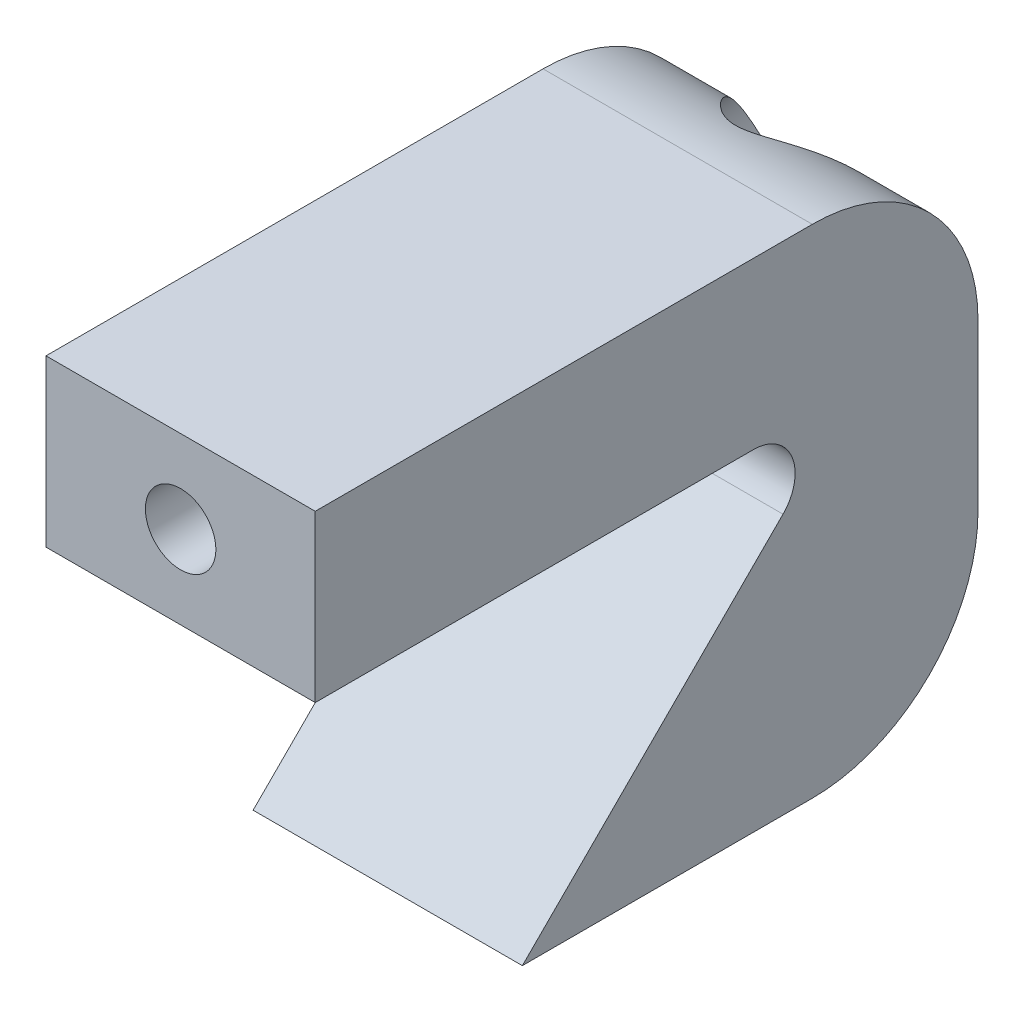
ISO-10303-21;
HEADER;
FILE_DESCRIPTION(('STEP AP214'),'2;1');
FILE_NAME('part.step','',(''),(''),'','','');
FILE_SCHEMA(('AUTOMOTIVE_DESIGN { 1 0 10303 214 1 1 1 1 }'));
ENDSEC;
DATA;
#1=APPLICATION_CONTEXT('core data for automotive mechanical design processes');
#2=APPLICATION_PROTOCOL_DEFINITION('international standard','automotive_design',2000,#1);
#3=PRODUCT_CONTEXT('',#1,'mechanical');
#4=PRODUCT('Part','Part','',(#3));
#5=PRODUCT_RELATED_PRODUCT_CATEGORY('part','',(#4));
#6=PRODUCT_DEFINITION_FORMATION('','',#4);
#7=PRODUCT_DEFINITION_CONTEXT('part definition',#1,'design');
#8=PRODUCT_DEFINITION('design','',#6,#7);
#9=PRODUCT_DEFINITION_SHAPE('','',#8);
#10=(LENGTH_UNIT() NAMED_UNIT(*) SI_UNIT(.MILLI.,.METRE.));
#11=(NAMED_UNIT(*) PLANE_ANGLE_UNIT() SI_UNIT($,.RADIAN.));
#12=(NAMED_UNIT(*) SI_UNIT($,.STERADIAN.) SOLID_ANGLE_UNIT());
#13=UNCERTAINTY_MEASURE_WITH_UNIT(LENGTH_MEASURE(1.E-05),#10,'distance_accuracy_value','');
#14=(GEOMETRIC_REPRESENTATION_CONTEXT(3) GLOBAL_UNCERTAINTY_ASSIGNED_CONTEXT((#13)) GLOBAL_UNIT_ASSIGNED_CONTEXT((#10,
#11,#12)) REPRESENTATION_CONTEXT('',''));
#15=CARTESIAN_POINT('',(0.,0.,0.));
#16=DIRECTION('',(0.,0.,1.));
#17=DIRECTION('',(1.,0.,0.));
#18=AXIS2_PLACEMENT_3D('',#15,#16,#17);
#19=CARTESIAN_POINT('',(6.5,4.,35.));
#20=DIRECTION('',(0.,0.,-1.));
#21=DIRECTION('',(-1.,0.,0.));
#22=AXIS2_PLACEMENT_3D('',#19,#20,#21);
#23=CYLINDRICAL_SURFACE('',#22,1.7);
#24=CARTESIAN_POINT('',(6.5,4.,23.45));
#25=DIRECTION('',(0.,0.,-1.));
#26=DIRECTION('',(-1.,0.,0.));
#27=AXIS2_PLACEMENT_3D('',#24,#25,#26);
#28=CIRCLE('',#27,1.7);
#29=CARTESIAN_POINT('',(4.8,4.,23.45));
#30=VERTEX_POINT('',#29);
#31=EDGE_CURVE('E285',#30,#30,#28,.T.);
#32=ORIENTED_EDGE('',*,*,#31,.T.);
#33=EDGE_LOOP('',(#32));
#34=FACE_BOUND('',#33,.T.);
#35=CARTESIAN_POINT('',(6.5,4.,26.));
#36=DIRECTION('',(0.,0.,-1.));
#37=DIRECTION('',(-1.,0.,0.));
#38=AXIS2_PLACEMENT_3D('',#35,#36,#37);
#39=CIRCLE('',#38,1.7);
#40=CARTESIAN_POINT('',(4.8,4.,26.));
#41=VERTEX_POINT('',#40);
#42=EDGE_CURVE('E157',#41,#41,#39,.T.);
#43=ORIENTED_EDGE('',*,*,#42,.F.);
#44=EDGE_LOOP('',(#43));
#45=FACE_BOUND('',#44,.T.);
#46=ADVANCED_FACE('F43',(#34,#45),#23,.F.);
#47=CARTESIAN_POINT('',(13.,-16.,-6.));
#48=DIRECTION('',(0.,0.,1.));
#49=DIRECTION('',(1.,0.,0.));
#50=AXIS2_PLACEMENT_3D('',#47,#48,#49);
#51=PLANE('',#50);
#52=DIRECTION('',(0.,1.,0.));
#53=VECTOR('',#52,1.);
#54=CARTESIAN_POINT('',(0.,-16.,-6.));
#55=LINE('',#54,#53);
#56=CARTESIAN_POINT('',(0.,-8.,-6.));
#57=VERTEX_POINT('',#56);
#58=CARTESIAN_POINT('',(0.,0.,-6.));
#59=VERTEX_POINT('',#58);
#60=EDGE_CURVE('E153',#57,#59,#55,.T.);
#61=ORIENTED_EDGE('',*,*,#60,.T.);
#62=DIRECTION('',(-1.,0.,0.));
#63=VECTOR('',#62,1.);
#64=CARTESIAN_POINT('',(13.,0.,-6.));
#65=LINE('',#64,#63);
#66=CARTESIAN_POINT('',(13.,0.,-6.));
#67=VERTEX_POINT('',#66);
#68=EDGE_CURVE('E191',#59,#67,#65,.F.);
#69=ORIENTED_EDGE('',*,*,#68,.T.);
#70=DIRECTION('',(0.,1.,0.));
#71=VECTOR('',#70,1.);
#72=CARTESIAN_POINT('',(13.,-16.,-6.));
#73=LINE('',#72,#71);
#74=CARTESIAN_POINT('',(13.,-8.,-6.));
#75=VERTEX_POINT('',#74);
#76=EDGE_CURVE('E127',#75,#67,#73,.T.);
#77=ORIENTED_EDGE('',*,*,#76,.F.);
#78=DIRECTION('',(-1.,0.,0.));
#79=VECTOR('',#78,1.);
#80=CARTESIAN_POINT('',(13.,-8.,-6.));
#81=LINE('',#80,#79);
#82=EDGE_CURVE('E187',#75,#57,#81,.T.);
#83=ORIENTED_EDGE('',*,*,#82,.T.);
#84=EDGE_LOOP('',(#61,#69,#77,#83));
#85=FACE_BOUND('',#84,.T.);
#86=ADVANCED_FACE('F228',(#85),#51,.F.);
#87=CARTESIAN_POINT('',(13.,8.00000000000001,-6.));
#88=DIRECTION('',(0.,-1.,0.));
#89=DIRECTION('',(0.,0.,-1.));
#90=AXIS2_PLACEMENT_3D('',#87,#88,#89);
#91=PLANE('',#90);
#92=DIRECTION('',(0.,0.,1.));
#93=VECTOR('',#92,1.);
#94=CARTESIAN_POINT('',(13.,8.00000000000001,-6.));
#95=LINE('',#94,#93);
#96=CARTESIAN_POINT('',(13.,8.,2.));
#97=VERTEX_POINT('',#96);
#98=CARTESIAN_POINT('',(13.,8.,26.));
#99=VERTEX_POINT('',#98);
#100=EDGE_CURVE('E114',#97,#99,#95,.T.);
#101=ORIENTED_EDGE('',*,*,#100,.F.);
#102=DIRECTION('',(-1.,0.,0.));
#103=VECTOR('',#102,1.);
#104=CARTESIAN_POINT('',(13.,8.,2.));
#105=LINE('',#104,#103);
#106=CARTESIAN_POINT('',(0.,8.,2.));
#107=VERTEX_POINT('',#106);
#108=EDGE_CURVE('E137',#97,#107,#105,.T.);
#109=ORIENTED_EDGE('',*,*,#108,.T.);
#110=DIRECTION('',(0.,0.,1.));
#111=VECTOR('',#110,1.);
#112=CARTESIAN_POINT('',(0.,8.00000000000001,-6.));
#113=LINE('',#112,#111);
#114=CARTESIAN_POINT('',(0.,8.,26.));
#115=VERTEX_POINT('',#114);
#116=EDGE_CURVE('E133',#107,#115,#113,.T.);
#117=ORIENTED_EDGE('',*,*,#116,.T.);
#118=DIRECTION('',(-1.,0.,0.));
#119=VECTOR('',#118,1.);
#120=CARTESIAN_POINT('',(13.,8.,26.));
#121=LINE('',#120,#119);
#122=EDGE_CURVE('E130',#99,#115,#121,.T.);
#123=ORIENTED_EDGE('',*,*,#122,.F.);
#124=EDGE_LOOP('',(#101,#109,#117,#123));
#125=FACE_BOUND('',#124,.T.);
#126=ADVANCED_FACE('F131',(#125),#91,.F.);
#127=CARTESIAN_POINT('',(13.,8.,26.));
#128=DIRECTION('',(0.,0.,-1.));
#129=DIRECTION('',(-1.,0.,0.));
#130=AXIS2_PLACEMENT_3D('',#127,#128,#129);
#131=PLANE('',#130);
#132=ORIENTED_EDGE('',*,*,#42,.T.);
#133=EDGE_LOOP('',(#132));
#134=FACE_BOUND('',#133,.T.);
#135=DIRECTION('',(0.,-1.,0.));
#136=VECTOR('',#135,1.);
#137=CARTESIAN_POINT('',(0.,8.,26.));
#138=LINE('',#137,#136);
#139=CARTESIAN_POINT('',(0.,0.,26.));
#140=VERTEX_POINT('',#139);
#141=EDGE_CURVE('E160',#115,#140,#138,.T.);
#142=ORIENTED_EDGE('',*,*,#141,.T.);
#143=DIRECTION('',(-1.,0.,0.));
#144=VECTOR('',#143,1.);
#145=CARTESIAN_POINT('',(13.,0.,26.));
#146=LINE('',#145,#144);
#147=CARTESIAN_POINT('',(13.,0.,26.));
#148=VERTEX_POINT('',#147);
#149=EDGE_CURVE('E138',#148,#140,#146,.T.);
#150=ORIENTED_EDGE('',*,*,#149,.F.);
#151=DIRECTION('',(0.,-1.,0.));
#152=VECTOR('',#151,1.);
#153=CARTESIAN_POINT('',(13.,8.,26.));
#154=LINE('',#153,#152);
#155=EDGE_CURVE('E119',#99,#148,#154,.T.);
#156=ORIENTED_EDGE('',*,*,#155,.F.);
#157=ORIENTED_EDGE('',*,*,#122,.T.);
#158=EDGE_LOOP('',(#142,#150,#156,#157));
#159=FACE_BOUND('',#158,.T.);
#160=ADVANCED_FACE('F140',(#134,#159),#131,.F.);
#161=CARTESIAN_POINT('',(13.,0.,26.));
#162=DIRECTION('',(0.,1.,0.));
#163=DIRECTION('',(0.,0.,1.));
#164=AXIS2_PLACEMENT_3D('',#161,#162,#163);
#165=PLANE('',#164);
#166=DIRECTION('',(0.,0.,-1.));
#167=VECTOR('',#166,1.);
#168=CARTESIAN_POINT('',(0.,0.,26.));
#169=LINE('',#168,#167);
#170=CARTESIAN_POINT('',(0.,0.,4.82842712474618));
#171=VERTEX_POINT('',#170);
#172=EDGE_CURVE('E163',#140,#171,#169,.T.);
#173=ORIENTED_EDGE('',*,*,#172,.T.);
#174=DIRECTION('',(-1.,0.,0.));
#175=VECTOR('',#174,1.);
#176=CARTESIAN_POINT('',(13.,0.,4.82842712474618));
#177=LINE('',#176,#175);
#178=CARTESIAN_POINT('',(13.,0.,4.82842712474618));
#179=VERTEX_POINT('',#178);
#180=EDGE_CURVE('E59',#171,#179,#177,.F.);
#181=ORIENTED_EDGE('',*,*,#180,.T.);
#182=DIRECTION('',(0.,0.,-1.));
#183=VECTOR('',#182,1.);
#184=CARTESIAN_POINT('',(13.,0.,26.));
#185=LINE('',#184,#183);
#186=EDGE_CURVE('E143',#148,#179,#185,.T.);
#187=ORIENTED_EDGE('',*,*,#186,.F.);
#188=ORIENTED_EDGE('',*,*,#149,.T.);
#189=EDGE_LOOP('',(#173,#181,#187,#188));
#190=FACE_BOUND('',#189,.T.);
#191=ADVANCED_FACE('F242',(#190),#165,.F.);
#192=CARTESIAN_POINT('',(13.,-16.,16.));
#193=DIRECTION('',(0.,-0.707106781186548,-0.707106781186547));
#194=DIRECTION('',(0.,0.707106781186547,-0.707106781186548));
#195=AXIS2_PLACEMENT_3D('',#192,#193,#194);
#196=PLANE('',#195);
#197=DIRECTION('',(0.,-0.707106781186547,0.707106781186548));
#198=VECTOR('',#197,1.);
#199=CARTESIAN_POINT('',(13.,-16.,16.));
#200=LINE('',#199,#198);
#201=CARTESIAN_POINT('',(13.,-3.4142135623731,3.41421356237309));
#202=VERTEX_POINT('',#201);
#203=CARTESIAN_POINT('',(13.,-16.,16.));
#204=VERTEX_POINT('',#203);
#205=EDGE_CURVE('E146',#202,#204,#200,.T.);
#206=ORIENTED_EDGE('',*,*,#205,.F.);
#207=DIRECTION('',(-1.,0.,0.));
#208=VECTOR('',#207,1.);
#209=CARTESIAN_POINT('',(0.,-3.4142135623731,3.41421356237309));
#210=LINE('',#209,#208);
#211=CARTESIAN_POINT('',(0.,-3.4142135623731,3.41421356237309));
#212=VERTEX_POINT('',#211);
#213=EDGE_CURVE('E202',#202,#212,#210,.T.);
#214=ORIENTED_EDGE('',*,*,#213,.T.);
#215=DIRECTION('',(0.,-0.707106781186547,0.707106781186548));
#216=VECTOR('',#215,1.);
#217=CARTESIAN_POINT('',(0.,-16.,16.));
#218=LINE('',#217,#216);
#219=CARTESIAN_POINT('',(0.,-16.,16.));
#220=VERTEX_POINT('',#219);
#221=EDGE_CURVE('E166',#212,#220,#218,.T.);
#222=ORIENTED_EDGE('',*,*,#221,.T.);
#223=DIRECTION('',(-1.,0.,0.));
#224=VECTOR('',#223,1.);
#225=CARTESIAN_POINT('',(13.,-16.,16.));
#226=LINE('',#225,#224);
#227=EDGE_CURVE('E152',#204,#220,#226,.T.);
#228=ORIENTED_EDGE('',*,*,#227,.F.);
#229=EDGE_LOOP('',(#206,#214,#222,#228));
#230=FACE_BOUND('',#229,.T.);
#231=ADVANCED_FACE('F238',(#230),#196,.F.);
#232=CARTESIAN_POINT('',(13.,-16.,0.));
#233=DIRECTION('',(0.,1.,0.));
#234=DIRECTION('',(0.,0.,1.));
#235=AXIS2_PLACEMENT_3D('',#232,#233,#234);
#236=PLANE('',#235);
#237=DIRECTION('',(0.,0.,-1.));
#238=VECTOR('',#237,1.);
#239=CARTESIAN_POINT('',(0.,-16.,0.));
#240=LINE('',#239,#238);
#241=CARTESIAN_POINT('',(0.,-16.,1.99999999999999));
#242=VERTEX_POINT('',#241);
#243=EDGE_CURVE('E169',#220,#242,#240,.T.);
#244=ORIENTED_EDGE('',*,*,#243,.T.);
#245=DIRECTION('',(-1.,0.,0.));
#246=VECTOR('',#245,1.);
#247=CARTESIAN_POINT('',(13.,-16.,1.99999999999999));
#248=LINE('',#247,#246);
#249=CARTESIAN_POINT('',(13.,-16.,1.99999999999999));
#250=VERTEX_POINT('',#249);
#251=EDGE_CURVE('E199',#242,#250,#248,.F.);
#252=ORIENTED_EDGE('',*,*,#251,.T.);
#253=DIRECTION('',(0.,0.,-1.));
#254=VECTOR('',#253,1.);
#255=CARTESIAN_POINT('',(13.,-16.,0.));
#256=LINE('',#255,#254);
#257=EDGE_CURVE('E173',#204,#250,#256,.T.);
#258=ORIENTED_EDGE('',*,*,#257,.F.);
#259=ORIENTED_EDGE('',*,*,#227,.T.);
#260=EDGE_LOOP('',(#244,#252,#258,#259));
#261=FACE_BOUND('',#260,.T.);
#262=ADVANCED_FACE('F233',(#261),#236,.F.);
#263=CARTESIAN_POINT('',(13.,0.,0.));
#264=DIRECTION('',(1.,0.,0.));
#265=DIRECTION('',(0.,0.,-1.));
#266=AXIS2_PLACEMENT_3D('',#263,#264,#265);
#267=PLANE('',#266);
#268=ORIENTED_EDGE('',*,*,#76,.T.);
#269=CARTESIAN_POINT('',(13.,0.,1.99999999999999));
#270=DIRECTION('',(1.,0.,0.));
#271=DIRECTION('',(0.,0.,-1.));
#272=AXIS2_PLACEMENT_3D('',#269,#270,#271);
#273=CIRCLE('',#272,8.);
#274=EDGE_CURVE('E122',#67,#97,#273,.T.);
#275=ORIENTED_EDGE('',*,*,#274,.T.);
#276=ORIENTED_EDGE('',*,*,#100,.T.);
#277=ORIENTED_EDGE('',*,*,#155,.T.);
#278=ORIENTED_EDGE('',*,*,#186,.T.);
#279=CARTESIAN_POINT('',(13.,-2.,4.82842712474618));
#280=DIRECTION('',(1.,0.,0.));
#281=DIRECTION('',(0.,0.,-1.));
#282=AXIS2_PLACEMENT_3D('',#279,#280,#281);
#283=CIRCLE('',#282,2.);
#284=EDGE_CURVE('E11',#179,#202,#283,.F.);
#285=ORIENTED_EDGE('',*,*,#284,.T.);
#286=ORIENTED_EDGE('',*,*,#205,.T.);
#287=ORIENTED_EDGE('',*,*,#257,.T.);
#288=CARTESIAN_POINT('',(13.,-8.,2.));
#289=DIRECTION('',(1.,0.,0.));
#290=DIRECTION('',(0.,0.,-1.));
#291=AXIS2_PLACEMENT_3D('',#288,#289,#290);
#292=CIRCLE('',#291,8.);
#293=EDGE_CURVE('E194',#250,#75,#292,.T.);
#294=ORIENTED_EDGE('',*,*,#293,.T.);
#295=EDGE_LOOP('',(#268,#275,#276,#277,#278,#285,#286,#287,#294));
#296=FACE_BOUND('',#295,.T.);
#297=ADVANCED_FACE('F117',(#296),#267,.T.);
#298=CARTESIAN_POINT('',(0.,0.,0.));
#299=DIRECTION('',(1.,0.,0.));
#300=DIRECTION('',(0.,0.,-1.));
#301=AXIS2_PLACEMENT_3D('',#298,#299,#300);
#302=PLANE('',#301);
#303=ORIENTED_EDGE('',*,*,#116,.F.);
#304=CARTESIAN_POINT('',(0.,0.,1.99999999999999));
#305=DIRECTION('',(1.,0.,0.));
#306=DIRECTION('',(0.,0.,-1.));
#307=AXIS2_PLACEMENT_3D('',#304,#305,#306);
#308=CIRCLE('',#307,8.);
#309=EDGE_CURVE('E184',#107,#59,#308,.F.);
#310=ORIENTED_EDGE('',*,*,#309,.T.);
#311=ORIENTED_EDGE('',*,*,#60,.F.);
#312=CARTESIAN_POINT('',(0.,-8.,2.));
#313=DIRECTION('',(1.,0.,0.));
#314=DIRECTION('',(0.,0.,-1.));
#315=AXIS2_PLACEMENT_3D('',#312,#313,#314);
#316=CIRCLE('',#315,8.);
#317=EDGE_CURVE('E181',#57,#242,#316,.F.);
#318=ORIENTED_EDGE('',*,*,#317,.T.);
#319=ORIENTED_EDGE('',*,*,#243,.F.);
#320=ORIENTED_EDGE('',*,*,#221,.F.);
#321=CARTESIAN_POINT('',(0.,-2.,4.82842712474618));
#322=DIRECTION('',(1.,0.,0.));
#323=DIRECTION('',(0.,0.,-1.));
#324=AXIS2_PLACEMENT_3D('',#321,#322,#323);
#325=CIRCLE('',#324,2.);
#326=EDGE_CURVE('E52',#212,#171,#325,.T.);
#327=ORIENTED_EDGE('',*,*,#326,.T.);
#328=ORIENTED_EDGE('',*,*,#172,.F.);
#329=ORIENTED_EDGE('',*,*,#141,.F.);
#330=EDGE_LOOP('',(#303,#310,#311,#318,#319,#320,#327,#328,#329));
#331=FACE_BOUND('',#330,.T.);
#332=ADVANCED_FACE('F232',(#331),#302,.F.);
#333=CARTESIAN_POINT('',(13.,0.,1.99999999999999));
#334=DIRECTION('',(-1.,0.,0.));
#335=DIRECTION('',(0.,0.,1.));
#336=AXIS2_PLACEMENT_3D('',#333,#334,#335);
#337=CYLINDRICAL_SURFACE('',#336,8.);
#338=CARTESIAN_POINT('',(3.,4.,-4.92820323027552));
#339=CARTESIAN_POINT('',(2.99999746456906,4.12946157465667,-4.85346109039603));
#340=CARTESIAN_POINT('',(3.00718518572057,4.25678660821189,-4.77509559939248));
#341=CARTESIAN_POINT('',(3.03449302306853,4.50594392281098,-4.61200840607057));
#342=CARTESIAN_POINT('',(3.05462220317708,4.62777229006225,-4.52728228566987));
#343=CARTESIAN_POINT('',(3.10646170457026,4.86528726797841,-4.35222936944765));
#344=CARTESIAN_POINT('',(3.13820626871232,4.98095454835899,-4.26188667611811));
#345=CARTESIAN_POINT('',(3.21192543811601,5.20519541977252,-4.0767659580053));
#346=CARTESIAN_POINT('',(3.25389894412933,5.31376977145487,-3.98198841069517));
#347=CARTESIAN_POINT('',(3.35409909934201,5.53975890372362,-3.77392068871624));
#348=CARTESIAN_POINT('',(3.41383448504187,5.65595125747378,-3.6600311849292));
#349=CARTESIAN_POINT('',(3.54394529538178,5.87839094816061,-3.42865448523742));
#350=CARTESIAN_POINT('',(3.61432411176587,5.98463509736335,-3.31116615204471));
#351=CARTESIAN_POINT('',(3.76473600442909,6.1872990887973,-3.07363130416703));
#352=CARTESIAN_POINT('',(3.84478126553267,6.28370624292251,-2.95358172116397));
#353=CARTESIAN_POINT('',(4.01377980395761,6.46662066467634,-2.71229453319615));
#354=CARTESIAN_POINT('',(4.10273056020809,6.55313071931464,-2.59105727317136));
#355=CARTESIAN_POINT('',(4.27171949480857,6.70090022597971,-2.37172280056365));
#356=CARTESIAN_POINT('',(4.35025468577091,6.76383877495346,-2.2735920731449));
#357=CARTESIAN_POINT('',(4.5133208692849,6.88328375134179,-2.07841647407525));
#358=CARTESIAN_POINT('',(4.59785078419433,6.93979133008707,-1.98137141087293));
#359=CARTESIAN_POINT('',(4.77317183771244,7.04606895165862,-1.79009643002905));
#360=CARTESIAN_POINT('',(4.86393596749246,7.09586559346581,-1.69585662577634));
#361=CARTESIAN_POINT('',(5.05311808635347,7.18867450554752,-1.51191100773961));
#362=CARTESIAN_POINT('',(5.15152785723778,7.23169391396285,-1.42220049208833));
#363=CARTESIAN_POINT('',(5.32849386423093,7.29905780829398,-1.2754084576558));
#364=CARTESIAN_POINT('',(5.4046824496328,7.32522511902617,-1.21633107730303));
#365=CARTESIAN_POINT('',(5.56316506940372,7.37330877548931,-1.10451549244808));
#366=CARTESIAN_POINT('',(5.64546961736387,7.39521755548786,-1.05178863238301));
#367=CARTESIAN_POINT('',(5.81837106306049,7.43414673706096,-0.955702939682146));
#368=CARTESIAN_POINT('',(5.90907486313324,7.45108789404666,-0.912498444939113));
#369=CARTESIAN_POINT('',(6.09750230545261,7.47806156871125,-0.842542460767034));
#370=CARTESIAN_POINT('',(6.1951884122415,7.48812834939866,-0.815709445665191));
#371=CARTESIAN_POINT('',(6.36505675435172,7.49810640600941,-0.789002491051568));
#372=CARTESIAN_POINT('',(6.43621941634113,7.50014297714707,-0.783496296772474));
#373=CARTESIAN_POINT('',(6.57848934704984,7.49984156920674,-0.784309699351116));
#374=CARTESIAN_POINT('',(6.64959660424867,7.49750284381348,-0.790631313734775));
#375=CARTESIAN_POINT('',(6.78924264431243,7.48872790508362,-0.814088849620029));
#376=CARTESIAN_POINT('',(6.85779378416755,7.48231518670802,-0.831162757105442));
#377=CARTESIAN_POINT('',(6.99164252081443,7.46595495632009,-0.874029592272438));
#378=CARTESIAN_POINT('',(7.05693680052312,7.45600392113225,-0.899831209064275));
#379=CARTESIAN_POINT('',(7.24121229762623,7.42282113625917,-0.98415428198663));
#380=CARTESIAN_POINT('',(7.3555274464071,7.39570405368212,-1.05120363373831));
#381=CARTESIAN_POINT('',(7.5732030846797,7.33333741236047,-1.19822339844616));
#382=CARTESIAN_POINT('',(7.676509977392,7.29805050211015,-1.27825263467803));
#383=CARTESIAN_POINT('',(7.88317492154839,7.21716997383584,-1.45290202612675));
#384=CARTESIAN_POINT('',(7.98571199555941,7.17093698675382,-1.54818698527479));
#385=CARTESIAN_POINT('',(8.18255213147739,7.07102603850722,-1.74334846883981));
#386=CARTESIAN_POINT('',(8.27684631787851,7.01734020959054,-1.84322976999795));
#387=CARTESIAN_POINT('',(8.45841725405714,6.90277854224969,-2.04538823055524));
#388=CARTESIAN_POINT('',(8.5456876350319,6.84189629926886,-2.14766745814704));
#389=CARTESIAN_POINT('',(8.71371919105751,6.71305226109017,-2.35311894934744));
#390=CARTESIAN_POINT('',(8.79447951797233,6.64508954607723,-2.4562913273838));
#391=CARTESIAN_POINT('',(8.95899699593348,6.49345326304894,-2.67491453069235));
#392=CARTESIAN_POINT('',(9.04194462548,6.40887329181545,-2.79034836451101));
#393=CARTESIAN_POINT('',(9.19965272305556,6.23070182234549,-3.0199085609704));
#394=CARTESIAN_POINT('',(9.27441125931967,6.13710820757978,-3.13403460945064));
#395=CARTESIAN_POINT('',(9.41496318139334,5.9410063762435,-3.35973250458937));
#396=CARTESIAN_POINT('',(9.48077278025099,5.83851484774023,-3.47130865729236));
#397=CARTESIAN_POINT('',(9.60260323493489,5.62450930221452,-3.69108702420716));
#398=CARTESIAN_POINT('',(9.65862291727446,5.51299420590587,-3.79928883267155));
#399=CARTESIAN_POINT('',(9.78702732651095,5.21798840383357,-4.06886685058908));
#400=CARTESIAN_POINT('',(9.85182876833608,5.02824226084837,-4.22728274201027));
#401=CARTESIAN_POINT('',(9.92468050447767,4.72943497252321,-4.45353663305662));
#402=CARTESIAN_POINT('',(9.94490530350572,4.62747745833904,-4.52705363762659));
#403=CARTESIAN_POINT('',(9.97639535114766,4.41923035760366,-4.66980499261658));
#404=CARTESIAN_POINT('',(9.98766215923082,4.31294152846623,-4.73904008652513));
#405=CARTESIAN_POINT('',(9.99924647380554,4.1153738064333,-4.86110598841301));
#406=CARTESIAN_POINT('',(10.0011148351155,4.02466037403275,-4.91470914630213));
#407=CARTESIAN_POINT('',(9.99760165028708,3.84129650224288,-5.01822745815726));
#408=CARTESIAN_POINT('',(9.99222161118161,3.74864646943945,-5.06814337647054));
#409=CARTESIAN_POINT('',(9.97375779125446,3.56205608756485,-5.16399026972017));
#410=CARTESIAN_POINT('',(9.96067434501351,3.46811579470637,-5.20992141762695));
#411=CARTESIAN_POINT('',(9.9264301850423,3.27976951558353,-5.29752645728501));
#412=CARTESIAN_POINT('',(9.90527341321446,3.1853637787477,-5.3392024141187));
#413=CARTESIAN_POINT('',(9.85444494401635,2.99633808842528,-5.41839096828322));
#414=CARTESIAN_POINT('',(9.82471984193459,2.90172060384234,-5.4558753407742));
#415=CARTESIAN_POINT('',(9.7566822403506,2.71392484310798,-5.52626490074006));
#416=CARTESIAN_POINT('',(9.71837349638174,2.62074595653811,-5.55917208066357));
#417=CARTESIAN_POINT('',(9.63317759610742,2.436840286102,-5.62044653768171));
#418=CARTESIAN_POINT('',(9.58629007638916,2.34611360630271,-5.64881362235403));
#419=CARTESIAN_POINT('',(9.48412213638718,2.1681876735775,-5.70114025233841));
#420=CARTESIAN_POINT('',(9.42884244490224,2.08098811517884,-5.72510017998064));
#421=CARTESIAN_POINT('',(9.31618406421796,1.91966473803274,-5.76666708282036));
#422=CARTESIAN_POINT('',(9.25957137423198,1.84510644085386,-5.78467014394488));
#423=CARTESIAN_POINT('',(9.14015431589075,1.70034953392004,-5.81756501428256));
#424=CARTESIAN_POINT('',(9.07734795012618,1.63015234256014,-5.83245581495626));
#425=CARTESIAN_POINT('',(8.94600081071604,1.49481255681251,-5.85940814112157));
#426=CARTESIAN_POINT('',(8.87746254077804,1.42966777923918,-5.8714708932437));
#427=CARTESIAN_POINT('',(8.73510785402021,1.30495527643636,-5.89310448146841));
#428=CARTESIAN_POINT('',(8.66128945798481,1.24538966204085,-5.90267437683704));
#429=CARTESIAN_POINT('',(8.43444075519922,1.07715608500411,-5.92795775964239));
#430=CARTESIAN_POINT('',(8.2743854769442,0.977272101326546,-5.94055748197226));
#431=CARTESIAN_POINT('',(7.94012355358784,0.804453885233686,-5.9599284399055));
#432=CARTESIAN_POINT('',(7.7659155355948,0.731522271159797,-5.96669910931889));
#433=CARTESIAN_POINT('',(7.40296939830651,0.612956438630944,-5.97671272645669));
#434=CARTESIAN_POINT('',(7.21396277429615,0.568132324858689,-5.97985300942568));
#435=CARTESIAN_POINT('',(6.83111886878331,0.510321289945744,-5.98375992265926));
#436=CARTESIAN_POINT('',(6.6372811640058,0.497337168440923,-5.98452634419585));
#437=CARTESIAN_POINT('',(6.24757134940876,0.503609517419297,-5.9841337703249));
#438=CARTESIAN_POINT('',(6.05170593681462,0.523291459389769,-5.98294936719401));
#439=CARTESIAN_POINT('',(5.66605102740068,0.595149647636035,-5.9779118103632));
#440=CARTESIAN_POINT('',(5.47626188347616,0.647327777626939,-5.9740585019527));
#441=CARTESIAN_POINT('',(5.10820046273071,0.782651077572862,-5.96191214541466));
#442=CARTESIAN_POINT('',(4.92992817066815,0.86579620654457,-5.95361910316288));
#443=CARTESIAN_POINT('',(4.59013529862023,1.06048650122199,-5.93000249230352));
#444=CARTESIAN_POINT('',(4.4286127784845,1.17202837250908,-5.91467973907529));
#445=CARTESIAN_POINT('',(4.12930520765897,1.41798869478832,-5.87429794256557));
#446=CARTESIAN_POINT('',(3.99121367093057,1.55205710609305,-5.8493812988186));
#447=CARTESIAN_POINT('',(3.73998479276436,1.83928469604492,-5.78707612671227));
#448=CARTESIAN_POINT('',(3.62684040238038,1.99243846283273,-5.74969112887214));
#449=CARTESIAN_POINT('',(3.43098697631735,2.30747907206938,-5.66169204430058));
#450=CARTESIAN_POINT('',(3.34752542428878,2.46900914570849,-5.61147073059822));
#451=CARTESIAN_POINT('',(3.207828986409,2.79849323647138,-5.49658734045521));
#452=CARTESIAN_POINT('',(3.15158735310663,2.96644565043363,-5.43192884861003));
#453=CARTESIAN_POINT('',(3.07145984908268,3.28043218995273,-5.29821357140865));
#454=CARTESIAN_POINT('',(3.04424818224488,3.42638761435051,-5.2309071636257));
#455=CARTESIAN_POINT('',(3.00851834880643,3.71573877488397,-5.0865657501542));
#456=CARTESIAN_POINT('',(3.00000275877704,3.85913415551053,-5.00952940509609));
#457=CARTESIAN_POINT('',(3.,4.,-4.92820323027552));
#458=B_SPLINE_CURVE_WITH_KNOTS('',3,(#338,#339,#340,#341,#342,#343,#344,#345,#346,#347,#348,
#349,#350,#351,#352,#353,#354,#355,#356,#357,#358,#359,#360,#361,#362,#363,#364,#365,#366,#367,
#368,#369,#370,#371,#372,#373,#374,#375,#376,#377,#378,#379,#380,#381,#382,#383,#384,#385,#386,
#387,#388,#389,#390,#391,#392,#393,#394,#395,#396,#397,#398,#399,#400,#401,#402,#403,#404,#405,
#406,#407,#408,#409,#410,#411,#412,#413,#414,#415,#416,#417,#418,#419,#420,#421,#422,#423,#424,
#425,#426,#427,#428,#429,#430,#431,#432,#433,#434,#435,#436,#437,#438,#439,#440,#441,#442,#443,
#444,#445,#446,#447,#448,#449,#450,#451,#452,#453,#454,#455,#456,#457),.UNSPECIFIED.,.T.,.F.,(4,
2,2,2,2,2,2,2,2,2,2,2,2,2,2,2,2,2,2,2,2,2,2,2,2,2,2,2,2,2,2,2,2,2,2,2,2,2,2,2,2,2,2,2,2,2,2,2,2,
2,2,2,2,2,2,2,2,2,2,4),(0.,0.448205338194614,0.896724931985161,1.34657758480751,
1.79638191573305,2.31561865051925,2.83502120060224,3.35508544363274,3.87500287491909,
4.29644467004602,4.7178108957475,5.13745455790195,5.55665323073495,5.85600439890305,
6.15588263039767,6.46031250109177,6.76321374697501,6.97636398188442,7.18955057816406,
7.401518739037,7.61369855478782,8.01715859009177,8.42250095245699,8.86407839453318,
9.30612559325394,9.74856920326203,10.1910703623952,10.6868385593799,11.1827234548172,
11.6776976182839,12.1727310721214,12.9360344138952,13.3176189463994,13.699137035464,
14.0149858820182,14.3307690697906,14.6465385432182,14.9621540351103,15.2797808823694,
15.597269031272,15.9147706326749,16.2322446771408,16.5178916996791,16.8036311441592,
17.0892464225046,17.3749693283782,17.9394177649567,18.5039210215925,19.0840251145061,
19.6641802131482,20.2519512185382,20.839756298577,21.4275606006872,22.0152967403416,
22.5946261022005,23.1737915611604,23.7370034238997,24.3000756024076,24.787696151415,
25.2753838968863),.UNSPECIFIED.);
#459=CARTESIAN_POINT('',(3.,4.,-4.92820323027552));
#460=VERTEX_POINT('',#459);
#461=EDGE_CURVE('E203',#460,#460,#458,.T.);
#462=ORIENTED_EDGE('',*,*,#461,.F.);
#463=EDGE_LOOP('',(#462));
#464=FACE_BOUND('',#463,.T.);
#465=ORIENTED_EDGE('',*,*,#274,.F.);
#466=ORIENTED_EDGE('',*,*,#68,.F.);
#467=ORIENTED_EDGE('',*,*,#309,.F.);
#468=ORIENTED_EDGE('',*,*,#108,.F.);
#469=EDGE_LOOP('',(#465,#466,#467,#468));
#470=FACE_BOUND('',#469,.T.);
#471=ADVANCED_FACE('F214',(#464,#470),#337,.T.);
#472=CARTESIAN_POINT('',(13.,-8.,2.));
#473=DIRECTION('',(-1.,0.,0.));
#474=DIRECTION('',(0.,0.,1.));
#475=AXIS2_PLACEMENT_3D('',#472,#473,#474);
#476=CYLINDRICAL_SURFACE('',#475,8.);
#477=ORIENTED_EDGE('',*,*,#293,.F.);
#478=ORIENTED_EDGE('',*,*,#251,.F.);
#479=ORIENTED_EDGE('',*,*,#317,.F.);
#480=ORIENTED_EDGE('',*,*,#82,.F.);
#481=EDGE_LOOP('',(#477,#478,#479,#480));
#482=FACE_BOUND('',#481,.T.);
#483=ADVANCED_FACE('F274',(#482),#476,.T.);
#484=CARTESIAN_POINT('',(6.5,4.,22.));
#485=DIRECTION('',(0.,0.,-1.));
#486=DIRECTION('',(-1.,0.,0.));
#487=AXIS2_PLACEMENT_3D('',#484,#485,#486);
#488=PLANE('',#487);
#489=CARTESIAN_POINT('',(6.5,4.,22.));
#490=DIRECTION('',(0.,0.,-1.));
#491=DIRECTION('',(-1.,0.,0.));
#492=AXIS2_PLACEMENT_3D('',#489,#490,#491);
#493=CIRCLE('',#492,3.15);
#494=CARTESIAN_POINT('',(3.35,4.,22.));
#495=VERTEX_POINT('',#494);
#496=EDGE_CURVE('E289',#495,#495,#493,.T.);
#497=ORIENTED_EDGE('',*,*,#496,.F.);
#498=EDGE_LOOP('',(#497));
#499=FACE_BOUND('',#498,.T.);
#500=CARTESIAN_POINT('',(6.5,4.,22.));
#501=DIRECTION('',(0.,0.,-1.));
#502=DIRECTION('',(-1.,0.,0.));
#503=AXIS2_PLACEMENT_3D('',#500,#501,#502);
#504=CIRCLE('',#503,3.5);
#505=CARTESIAN_POINT('',(3.,4.,22.));
#506=VERTEX_POINT('',#505);
#507=EDGE_CURVE('E212',#506,#506,#504,.T.);
#508=ORIENTED_EDGE('',*,*,#507,.T.);
#509=EDGE_LOOP('',(#508));
#510=FACE_BOUND('',#509,.T.);
#511=ADVANCED_FACE('F223',(#499,#510),#488,.T.);
#512=CARTESIAN_POINT('',(6.5,4.,22.));
#513=DIRECTION('',(0.,0.,-1.));
#514=DIRECTION('',(-1.,0.,0.));
#515=AXIS2_PLACEMENT_3D('',#512,#513,#514);
#516=CYLINDRICAL_SURFACE('',#515,3.5);
#517=ORIENTED_EDGE('',*,*,#461,.T.);
#518=EDGE_LOOP('',(#517));
#519=FACE_BOUND('',#518,.T.);
#520=ORIENTED_EDGE('',*,*,#507,.F.);
#521=EDGE_LOOP('',(#520));
#522=FACE_BOUND('',#521,.T.);
#523=ADVANCED_FACE('F217',(#519,#522),#516,.F.);
#524=CARTESIAN_POINT('',(6.5,4.,22.));
#525=DIRECTION('',(0.,0.,-1.));
#526=DIRECTION('',(-1.,0.,0.));
#527=AXIS2_PLACEMENT_3D('',#524,#525,#526);
#528=CONICAL_SURFACE('',#527,3.15,0.785398163397447);
#529=ORIENTED_EDGE('',*,*,#496,.T.);
#530=EDGE_LOOP('',(#529));
#531=FACE_BOUND('',#530,.T.);
#532=ORIENTED_EDGE('',*,*,#31,.F.);
#533=EDGE_LOOP('',(#532));
#534=FACE_BOUND('',#533,.T.);
#535=ADVANCED_FACE('F222',(#531,#534),#528,.F.);
#536=CARTESIAN_POINT('',(13.,-2.,4.82842712474618));
#537=DIRECTION('',(1.,0.,0.));
#538=DIRECTION('',(0.,0.,-1.));
#539=AXIS2_PLACEMENT_3D('',#536,#537,#538);
#540=CYLINDRICAL_SURFACE('',#539,2.);
#541=ORIENTED_EDGE('',*,*,#284,.F.);
#542=ORIENTED_EDGE('',*,*,#180,.F.);
#543=ORIENTED_EDGE('',*,*,#326,.F.);
#544=ORIENTED_EDGE('',*,*,#213,.F.);
#545=EDGE_LOOP('',(#541,#542,#543,#544));
#546=FACE_BOUND('',#545,.T.);
#547=ADVANCED_FACE('F45',(#546),#540,.F.);
#548=CLOSED_SHELL('',(#46,#86,#126,#160,#191,#231,#262,#297,#332,#471,#483,#511,#523,#535,#547));
#549=MANIFOLD_SOLID_BREP('B2',#548);
#550=ADVANCED_BREP_SHAPE_REPRESENTATION('',(#18,#549),#14);
#551=SHAPE_DEFINITION_REPRESENTATION(#9,#550);
ENDSEC;
END-ISO-10303-21;
